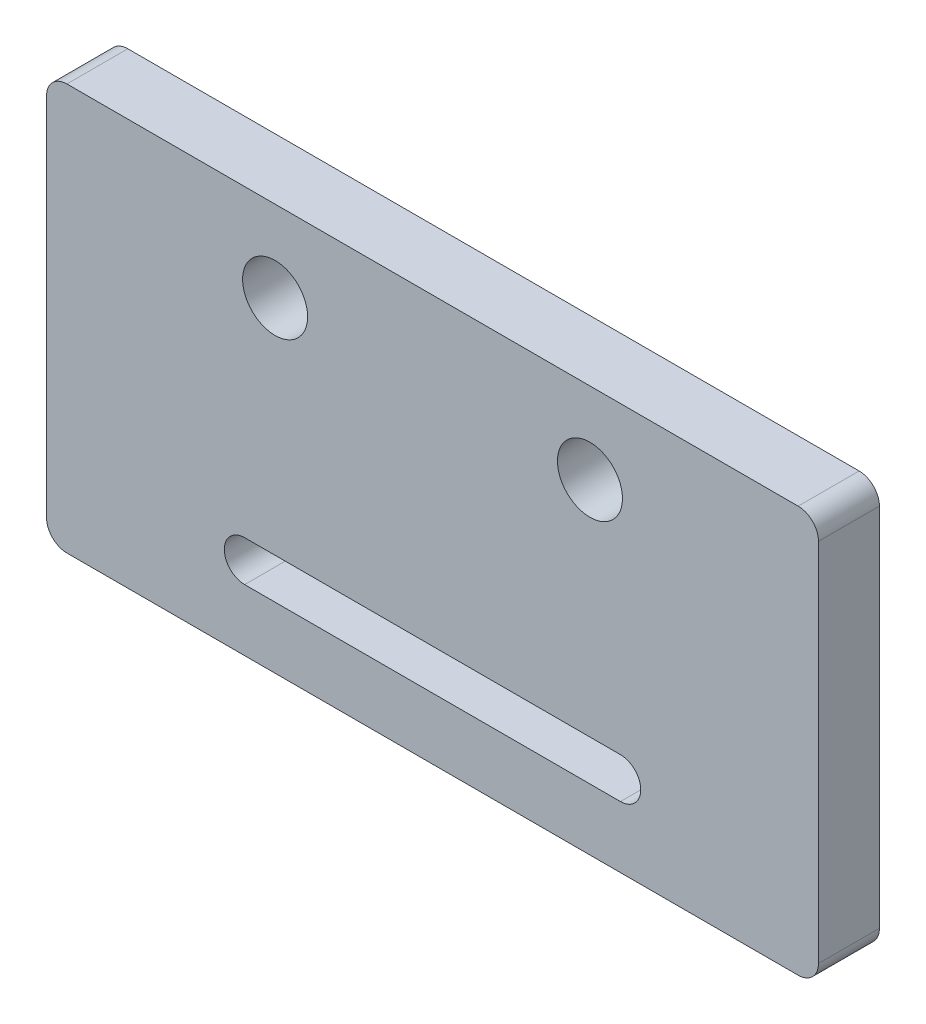
ISO-10303-21;
HEADER;
FILE_DESCRIPTION(('STEP AP214'),'2;1');
FILE_NAME('part.step','',(''),(''),'','','');
FILE_SCHEMA(('AUTOMOTIVE_DESIGN { 1 0 10303 214 1 1 1 1 }'));
ENDSEC;
DATA;
#1=APPLICATION_CONTEXT('core data for automotive mechanical design processes');
#2=APPLICATION_PROTOCOL_DEFINITION('international standard','automotive_design',2000,#1);
#3=PRODUCT_CONTEXT('',#1,'mechanical');
#4=PRODUCT('Part','Part','',(#3));
#5=PRODUCT_RELATED_PRODUCT_CATEGORY('part','',(#4));
#6=PRODUCT_DEFINITION_FORMATION('','',#4);
#7=PRODUCT_DEFINITION_CONTEXT('part definition',#1,'design');
#8=PRODUCT_DEFINITION('design','',#6,#7);
#9=PRODUCT_DEFINITION_SHAPE('','',#8);
#10=(LENGTH_UNIT() NAMED_UNIT(*) SI_UNIT(.MILLI.,.METRE.));
#11=(NAMED_UNIT(*) PLANE_ANGLE_UNIT() SI_UNIT($,.RADIAN.));
#12=(NAMED_UNIT(*) SI_UNIT($,.STERADIAN.) SOLID_ANGLE_UNIT());
#13=UNCERTAINTY_MEASURE_WITH_UNIT(LENGTH_MEASURE(1.E-05),#10,'distance_accuracy_value','');
#14=(GEOMETRIC_REPRESENTATION_CONTEXT(3) GLOBAL_UNCERTAINTY_ASSIGNED_CONTEXT((#13)) GLOBAL_UNIT_ASSIGNED_CONTEXT((#10,
#11,#12)) REPRESENTATION_CONTEXT('',''));
#15=CARTESIAN_POINT('',(0.,0.,0.));
#16=DIRECTION('',(0.,0.,1.));
#17=DIRECTION('',(1.,0.,0.));
#18=AXIS2_PLACEMENT_3D('',#15,#16,#17);
#19=CARTESIAN_POINT('',(0.,0.,3.));
#20=DIRECTION('',(0.,0.,1.));
#21=DIRECTION('',(1.,0.,0.));
#22=AXIS2_PLACEMENT_3D('',#19,#20,#21);
#23=PLANE('',#22);
#24=DIRECTION('',(0.,-1.,0.));
#25=VECTOR('',#24,1.);
#26=CARTESIAN_POINT('',(-38.,0.,3.));
#27=LINE('',#26,#25);
#28=CARTESIAN_POINT('',(-38.,19.,3.));
#29=VERTEX_POINT('',#28);
#30=CARTESIAN_POINT('',(-38.,1.,3.));
#31=VERTEX_POINT('',#30);
#32=EDGE_CURVE('E186',#29,#31,#27,.T.);
#33=ORIENTED_EDGE('',*,*,#32,.T.);
#34=CARTESIAN_POINT('',(-37.,1.,3.));
#35=DIRECTION('',(0.,0.,1.));
#36=DIRECTION('',(1.,0.,0.));
#37=AXIS2_PLACEMENT_3D('',#34,#35,#36);
#38=CIRCLE('',#37,1.);
#39=CARTESIAN_POINT('',(-37.,0.,3.));
#40=VERTEX_POINT('',#39);
#41=EDGE_CURVE('E224',#31,#40,#38,.T.);
#42=ORIENTED_EDGE('',*,*,#41,.T.);
#43=DIRECTION('',(1.,0.,0.));
#44=VECTOR('',#43,1.);
#45=CARTESIAN_POINT('',(0.,0.,3.));
#46=LINE('',#45,#44);
#47=CARTESIAN_POINT('',(-1.,0.,3.));
#48=VERTEX_POINT('',#47);
#49=EDGE_CURVE('E189',#40,#48,#46,.T.);
#50=ORIENTED_EDGE('',*,*,#49,.T.);
#51=CARTESIAN_POINT('',(-1.,1.,3.));
#52=DIRECTION('',(0.,0.,1.));
#53=DIRECTION('',(1.,0.,0.));
#54=AXIS2_PLACEMENT_3D('',#51,#52,#53);
#55=CIRCLE('',#54,1.);
#56=CARTESIAN_POINT('',(0.,1.,3.));
#57=VERTEX_POINT('',#56);
#58=EDGE_CURVE('E222',#48,#57,#55,.T.);
#59=ORIENTED_EDGE('',*,*,#58,.T.);
#60=DIRECTION('',(0.,1.,0.));
#61=VECTOR('',#60,1.);
#62=CARTESIAN_POINT('',(0.,0.,3.));
#63=LINE('',#62,#61);
#64=CARTESIAN_POINT('',(0.,19.,3.));
#65=VERTEX_POINT('',#64);
#66=EDGE_CURVE('E181',#57,#65,#63,.T.);
#67=ORIENTED_EDGE('',*,*,#66,.T.);
#68=CARTESIAN_POINT('',(-1.,19.,3.));
#69=DIRECTION('',(0.,0.,1.));
#70=DIRECTION('',(1.,0.,0.));
#71=AXIS2_PLACEMENT_3D('',#68,#69,#70);
#72=CIRCLE('',#71,1.);
#73=CARTESIAN_POINT('',(-1.,20.,3.));
#74=VERTEX_POINT('',#73);
#75=EDGE_CURVE('E57',#65,#74,#72,.T.);
#76=ORIENTED_EDGE('',*,*,#75,.T.);
#77=DIRECTION('',(-1.,0.,0.));
#78=VECTOR('',#77,1.);
#79=CARTESIAN_POINT('',(0.,20.,3.));
#80=LINE('',#79,#78);
#81=CARTESIAN_POINT('',(-37.,20.,3.));
#82=VERTEX_POINT('',#81);
#83=EDGE_CURVE('E183',#74,#82,#80,.T.);
#84=ORIENTED_EDGE('',*,*,#83,.T.);
#85=CARTESIAN_POINT('',(-37.,19.,3.));
#86=DIRECTION('',(0.,0.,1.));
#87=DIRECTION('',(1.,0.,0.));
#88=AXIS2_PLACEMENT_3D('',#85,#86,#87);
#89=CIRCLE('',#88,1.);
#90=EDGE_CURVE('E219',#82,#29,#89,.T.);
#91=ORIENTED_EDGE('',*,*,#90,.T.);
#92=EDGE_LOOP('',(#33,#42,#50,#59,#67,#76,#84,#91));
#93=FACE_BOUND('',#92,.T.);
#94=CARTESIAN_POINT('',(-26.75,16.,3.));
#95=DIRECTION('',(0.,0.,1.));
#96=DIRECTION('',(1.,0.,0.));
#97=AXIS2_PLACEMENT_3D('',#94,#95,#96);
#98=CIRCLE('',#97,1.6);
#99=CARTESIAN_POINT('',(-25.15,16.,3.));
#100=VERTEX_POINT('',#99);
#101=EDGE_CURVE('E174',#100,#100,#98,.T.);
#102=ORIENTED_EDGE('',*,*,#101,.F.);
#103=EDGE_LOOP('',(#102));
#104=FACE_BOUND('',#103,.T.);
#105=CARTESIAN_POINT('',(-11.25,16.,3.));
#106=DIRECTION('',(0.,0.,1.));
#107=DIRECTION('',(1.,0.,0.));
#108=AXIS2_PLACEMENT_3D('',#105,#106,#107);
#109=CIRCLE('',#108,1.6);
#110=CARTESIAN_POINT('',(-9.65,16.,3.));
#111=VERTEX_POINT('',#110);
#112=EDGE_CURVE('E165',#111,#111,#109,.T.);
#113=ORIENTED_EDGE('',*,*,#112,.F.);
#114=EDGE_LOOP('',(#113));
#115=FACE_BOUND('',#114,.T.);
#116=CARTESIAN_POINT('',(-9.75,4.03,3.));
#117=DIRECTION('',(0.,0.,1.));
#118=DIRECTION('',(1.,0.,0.));
#119=AXIS2_PLACEMENT_3D('',#116,#117,#118);
#120=CIRCLE('',#119,1.);
#121=CARTESIAN_POINT('',(-9.75,3.03,3.));
#122=VERTEX_POINT('',#121);
#123=CARTESIAN_POINT('',(-9.75,5.03,3.));
#124=VERTEX_POINT('',#123);
#125=EDGE_CURVE('E159',#122,#124,#120,.T.);
#126=ORIENTED_EDGE('',*,*,#125,.F.);
#127=DIRECTION('',(-1.,0.,0.));
#128=VECTOR('',#127,1.);
#129=CARTESIAN_POINT('',(0.,3.03000000000001,3.));
#130=LINE('',#129,#128);
#131=CARTESIAN_POINT('',(-28.25,3.03,3.));
#132=VERTEX_POINT('',#131);
#133=EDGE_CURVE('E132',#122,#132,#130,.T.);
#134=ORIENTED_EDGE('',*,*,#133,.T.);
#135=CARTESIAN_POINT('',(-28.25,4.03,3.));
#136=DIRECTION('',(0.,0.,1.));
#137=DIRECTION('',(1.,0.,0.));
#138=AXIS2_PLACEMENT_3D('',#135,#136,#137);
#139=CIRCLE('',#138,1.);
#140=CARTESIAN_POINT('',(-28.25,5.03,3.));
#141=VERTEX_POINT('',#140);
#142=EDGE_CURVE('E150',#141,#132,#139,.T.);
#143=ORIENTED_EDGE('',*,*,#142,.F.);
#144=DIRECTION('',(-1.,0.,0.));
#145=VECTOR('',#144,1.);
#146=CARTESIAN_POINT('',(0.,5.03000000000001,3.));
#147=LINE('',#146,#145);
#148=EDGE_CURVE('E153',#124,#141,#147,.T.);
#149=ORIENTED_EDGE('',*,*,#148,.F.);
#150=EDGE_LOOP('',(#126,#134,#143,#149));
#151=FACE_BOUND('',#150,.T.);
#152=ADVANCED_FACE('F36',(#93,#104,#115,#151),#23,.T.);
#153=CARTESIAN_POINT('',(0.,0.,0.));
#154=DIRECTION('',(0.,0.,1.));
#155=DIRECTION('',(1.,0.,0.));
#156=AXIS2_PLACEMENT_3D('',#153,#154,#155);
#157=PLANE('',#156);
#158=DIRECTION('',(1.,0.,0.));
#159=VECTOR('',#158,1.);
#160=CARTESIAN_POINT('',(0.,0.,0.));
#161=LINE('',#160,#159);
#162=CARTESIAN_POINT('',(-37.,0.,0.));
#163=VERTEX_POINT('',#162);
#164=CARTESIAN_POINT('',(-1.,0.,0.));
#165=VERTEX_POINT('',#164);
#166=EDGE_CURVE('E184',#163,#165,#161,.T.);
#167=ORIENTED_EDGE('',*,*,#166,.F.);
#168=CARTESIAN_POINT('',(-37.,1.,0.));
#169=DIRECTION('',(0.,0.,1.));
#170=DIRECTION('',(1.,0.,0.));
#171=AXIS2_PLACEMENT_3D('',#168,#169,#170);
#172=CIRCLE('',#171,1.);
#173=CARTESIAN_POINT('',(-38.,1.,0.));
#174=VERTEX_POINT('',#173);
#175=EDGE_CURVE('E212',#163,#174,#172,.F.);
#176=ORIENTED_EDGE('',*,*,#175,.T.);
#177=DIRECTION('',(0.,-1.,0.));
#178=VECTOR('',#177,1.);
#179=CARTESIAN_POINT('',(-38.,0.,0.));
#180=LINE('',#179,#178);
#181=CARTESIAN_POINT('',(-38.,19.,0.));
#182=VERTEX_POINT('',#181);
#183=EDGE_CURVE('E197',#182,#174,#180,.T.);
#184=ORIENTED_EDGE('',*,*,#183,.F.);
#185=CARTESIAN_POINT('',(-37.,19.,0.));
#186=DIRECTION('',(0.,0.,1.));
#187=DIRECTION('',(1.,0.,0.));
#188=AXIS2_PLACEMENT_3D('',#185,#186,#187);
#189=CIRCLE('',#188,1.);
#190=CARTESIAN_POINT('',(-37.,20.,0.));
#191=VERTEX_POINT('',#190);
#192=EDGE_CURVE('E206',#182,#191,#189,.F.);
#193=ORIENTED_EDGE('',*,*,#192,.T.);
#194=DIRECTION('',(-1.,0.,0.));
#195=VECTOR('',#194,1.);
#196=CARTESIAN_POINT('',(0.,20.,0.));
#197=LINE('',#196,#195);
#198=CARTESIAN_POINT('',(-1.,20.,0.));
#199=VERTEX_POINT('',#198);
#200=EDGE_CURVE('E195',#199,#191,#197,.T.);
#201=ORIENTED_EDGE('',*,*,#200,.F.);
#202=CARTESIAN_POINT('',(-1.,19.,0.));
#203=DIRECTION('',(0.,0.,1.));
#204=DIRECTION('',(1.,0.,0.));
#205=AXIS2_PLACEMENT_3D('',#202,#203,#204);
#206=CIRCLE('',#205,1.);
#207=CARTESIAN_POINT('',(0.,19.,0.));
#208=VERTEX_POINT('',#207);
#209=EDGE_CURVE('E208',#199,#208,#206,.F.);
#210=ORIENTED_EDGE('',*,*,#209,.T.);
#211=DIRECTION('',(0.,1.,0.));
#212=VECTOR('',#211,1.);
#213=CARTESIAN_POINT('',(0.,0.,0.));
#214=LINE('',#213,#212);
#215=CARTESIAN_POINT('',(0.,1.,0.));
#216=VERTEX_POINT('',#215);
#217=EDGE_CURVE('E180',#216,#208,#214,.T.);
#218=ORIENTED_EDGE('',*,*,#217,.F.);
#219=CARTESIAN_POINT('',(-1.,1.,0.));
#220=DIRECTION('',(0.,0.,1.));
#221=DIRECTION('',(1.,0.,0.));
#222=AXIS2_PLACEMENT_3D('',#219,#220,#221);
#223=CIRCLE('',#222,1.);
#224=EDGE_CURVE('E210',#216,#165,#223,.F.);
#225=ORIENTED_EDGE('',*,*,#224,.T.);
#226=EDGE_LOOP('',(#167,#176,#184,#193,#201,#210,#218,#225));
#227=FACE_BOUND('',#226,.T.);
#228=CARTESIAN_POINT('',(-26.75,16.,0.));
#229=DIRECTION('',(0.,0.,1.));
#230=DIRECTION('',(1.,0.,0.));
#231=AXIS2_PLACEMENT_3D('',#228,#229,#230);
#232=CIRCLE('',#231,1.6);
#233=CARTESIAN_POINT('',(-25.15,16.,0.));
#234=VERTEX_POINT('',#233);
#235=EDGE_CURVE('E177',#234,#234,#232,.T.);
#236=ORIENTED_EDGE('',*,*,#235,.T.);
#237=EDGE_LOOP('',(#236));
#238=FACE_BOUND('',#237,.T.);
#239=CARTESIAN_POINT('',(-11.25,16.,0.));
#240=DIRECTION('',(0.,0.,1.));
#241=DIRECTION('',(1.,0.,0.));
#242=AXIS2_PLACEMENT_3D('',#239,#240,#241);
#243=CIRCLE('',#242,1.6);
#244=CARTESIAN_POINT('',(-9.65,16.,0.));
#245=VERTEX_POINT('',#244);
#246=EDGE_CURVE('E171',#245,#245,#243,.T.);
#247=ORIENTED_EDGE('',*,*,#246,.T.);
#248=EDGE_LOOP('',(#247));
#249=FACE_BOUND('',#248,.T.);
#250=DIRECTION('',(-1.,0.,0.));
#251=VECTOR('',#250,1.);
#252=CARTESIAN_POINT('',(0.,3.03000000000001,0.));
#253=LINE('',#252,#251);
#254=CARTESIAN_POINT('',(-9.75,3.03,0.));
#255=VERTEX_POINT('',#254);
#256=CARTESIAN_POINT('',(-28.25,3.03,0.));
#257=VERTEX_POINT('',#256);
#258=EDGE_CURVE('E129',#255,#257,#253,.T.);
#259=ORIENTED_EDGE('',*,*,#258,.F.);
#260=CARTESIAN_POINT('',(-9.75,4.03,0.));
#261=DIRECTION('',(0.,0.,1.));
#262=DIRECTION('',(1.,0.,0.));
#263=AXIS2_PLACEMENT_3D('',#260,#261,#262);
#264=CIRCLE('',#263,1.);
#265=CARTESIAN_POINT('',(-9.75,5.03,0.));
#266=VERTEX_POINT('',#265);
#267=EDGE_CURVE('E141',#255,#266,#264,.T.);
#268=ORIENTED_EDGE('',*,*,#267,.T.);
#269=DIRECTION('',(-1.,0.,0.));
#270=VECTOR('',#269,1.);
#271=CARTESIAN_POINT('',(0.,5.03000000000001,0.));
#272=LINE('',#271,#270);
#273=CARTESIAN_POINT('',(-28.25,5.03,0.));
#274=VERTEX_POINT('',#273);
#275=EDGE_CURVE('E145',#266,#274,#272,.T.);
#276=ORIENTED_EDGE('',*,*,#275,.T.);
#277=CARTESIAN_POINT('',(-28.25,4.03,0.));
#278=DIRECTION('',(0.,0.,1.));
#279=DIRECTION('',(1.,0.,0.));
#280=AXIS2_PLACEMENT_3D('',#277,#278,#279);
#281=CIRCLE('',#280,1.);
#282=EDGE_CURVE('E137',#274,#257,#281,.T.);
#283=ORIENTED_EDGE('',*,*,#282,.T.);
#284=EDGE_LOOP('',(#259,#268,#276,#283));
#285=FACE_BOUND('',#284,.T.);
#286=ADVANCED_FACE('F148',(#227,#238,#249,#285),#157,.F.);
#287=CARTESIAN_POINT('',(0.,0.,3.));
#288=DIRECTION('',(-1.,0.,0.));
#289=DIRECTION('',(0.,0.,1.));
#290=AXIS2_PLACEMENT_3D('',#287,#288,#289);
#291=PLANE('',#290);
#292=ORIENTED_EDGE('',*,*,#66,.F.);
#293=DIRECTION('',(0.,0.,-1.));
#294=VECTOR('',#293,1.);
#295=CARTESIAN_POINT('',(0.,1.,3.));
#296=LINE('',#295,#294);
#297=EDGE_CURVE('E228',#57,#216,#296,.T.);
#298=ORIENTED_EDGE('',*,*,#297,.T.);
#299=ORIENTED_EDGE('',*,*,#217,.T.);
#300=DIRECTION('',(0.,0.,-1.));
#301=VECTOR('',#300,1.);
#302=CARTESIAN_POINT('',(0.,19.,3.));
#303=LINE('',#302,#301);
#304=EDGE_CURVE('E226',#208,#65,#303,.F.);
#305=ORIENTED_EDGE('',*,*,#304,.T.);
#306=EDGE_LOOP('',(#292,#298,#299,#305));
#307=FACE_BOUND('',#306,.T.);
#308=ADVANCED_FACE('F234',(#307),#291,.F.);
#309=CARTESIAN_POINT('',(0.,20.,3.));
#310=DIRECTION('',(0.,-1.,0.));
#311=DIRECTION('',(1.,0.,0.));
#312=AXIS2_PLACEMENT_3D('',#309,#310,#311);
#313=PLANE('',#312);
#314=ORIENTED_EDGE('',*,*,#83,.F.);
#315=DIRECTION('',(0.,0.,-1.));
#316=VECTOR('',#315,1.);
#317=CARTESIAN_POINT('',(-1.,20.,3.));
#318=LINE('',#317,#316);
#319=EDGE_CURVE('E11',#74,#199,#318,.T.);
#320=ORIENTED_EDGE('',*,*,#319,.T.);
#321=ORIENTED_EDGE('',*,*,#200,.T.);
#322=DIRECTION('',(0.,0.,-1.));
#323=VECTOR('',#322,1.);
#324=CARTESIAN_POINT('',(-37.,20.,3.));
#325=LINE('',#324,#323);
#326=EDGE_CURVE('E44',#191,#82,#325,.F.);
#327=ORIENTED_EDGE('',*,*,#326,.T.);
#328=EDGE_LOOP('',(#314,#320,#321,#327));
#329=FACE_BOUND('',#328,.T.);
#330=ADVANCED_FACE('F245',(#329),#313,.F.);
#331=CARTESIAN_POINT('',(-38.,0.,3.));
#332=DIRECTION('',(1.,0.,0.));
#333=DIRECTION('',(0.,0.,-1.));
#334=AXIS2_PLACEMENT_3D('',#331,#332,#333);
#335=PLANE('',#334);
#336=ORIENTED_EDGE('',*,*,#183,.T.);
#337=DIRECTION('',(0.,0.,-1.));
#338=VECTOR('',#337,1.);
#339=CARTESIAN_POINT('',(-38.,1.,3.));
#340=LINE('',#339,#338);
#341=EDGE_CURVE('E217',#174,#31,#340,.F.);
#342=ORIENTED_EDGE('',*,*,#341,.T.);
#343=ORIENTED_EDGE('',*,*,#32,.F.);
#344=DIRECTION('',(0.,0.,-1.));
#345=VECTOR('',#344,1.);
#346=CARTESIAN_POINT('',(-38.,19.,3.));
#347=LINE('',#346,#345);
#348=EDGE_CURVE('E214',#29,#182,#347,.T.);
#349=ORIENTED_EDGE('',*,*,#348,.T.);
#350=EDGE_LOOP('',(#336,#342,#343,#349));
#351=FACE_BOUND('',#350,.T.);
#352=ADVANCED_FACE('F253',(#351),#335,.F.);
#353=CARTESIAN_POINT('',(0.,0.,3.));
#354=DIRECTION('',(0.,1.,0.));
#355=DIRECTION('',(0.,0.,1.));
#356=AXIS2_PLACEMENT_3D('',#353,#354,#355);
#357=PLANE('',#356);
#358=ORIENTED_EDGE('',*,*,#49,.F.);
#359=DIRECTION('',(0.,0.,-1.));
#360=VECTOR('',#359,1.);
#361=CARTESIAN_POINT('',(-37.,0.,3.));
#362=LINE('',#361,#360);
#363=EDGE_CURVE('E203',#40,#163,#362,.T.);
#364=ORIENTED_EDGE('',*,*,#363,.T.);
#365=ORIENTED_EDGE('',*,*,#166,.T.);
#366=DIRECTION('',(0.,0.,-1.));
#367=VECTOR('',#366,1.);
#368=CARTESIAN_POINT('',(-1.,0.,3.));
#369=LINE('',#368,#367);
#370=EDGE_CURVE('E192',#165,#48,#369,.F.);
#371=ORIENTED_EDGE('',*,*,#370,.T.);
#372=EDGE_LOOP('',(#358,#364,#365,#371));
#373=FACE_BOUND('',#372,.T.);
#374=ADVANCED_FACE('F261',(#373),#357,.F.);
#375=CARTESIAN_POINT('',(-26.75,16.,3.));
#376=DIRECTION('',(0.,0.,1.));
#377=DIRECTION('',(1.,0.,0.));
#378=AXIS2_PLACEMENT_3D('',#375,#376,#377);
#379=CYLINDRICAL_SURFACE('',#378,1.6);
#380=ORIENTED_EDGE('',*,*,#101,.T.);
#381=EDGE_LOOP('',(#380));
#382=FACE_BOUND('',#381,.T.);
#383=ORIENTED_EDGE('',*,*,#235,.F.);
#384=EDGE_LOOP('',(#383));
#385=FACE_BOUND('',#384,.T.);
#386=ADVANCED_FACE('F278',(#382,#385),#379,.F.);
#387=CARTESIAN_POINT('',(-11.25,16.,3.));
#388=DIRECTION('',(0.,0.,1.));
#389=DIRECTION('',(1.,0.,0.));
#390=AXIS2_PLACEMENT_3D('',#387,#388,#389);
#391=CYLINDRICAL_SURFACE('',#390,1.6);
#392=ORIENTED_EDGE('',*,*,#112,.T.);
#393=EDGE_LOOP('',(#392));
#394=FACE_BOUND('',#393,.T.);
#395=ORIENTED_EDGE('',*,*,#246,.F.);
#396=EDGE_LOOP('',(#395));
#397=FACE_BOUND('',#396,.T.);
#398=ADVANCED_FACE('F311',(#394,#397),#391,.F.);
#399=CARTESIAN_POINT('',(0.,3.03000000000001,0.));
#400=DIRECTION('',(0.,1.,0.));
#401=DIRECTION('',(-1.,0.,0.));
#402=AXIS2_PLACEMENT_3D('',#399,#400,#401);
#403=PLANE('',#402);
#404=ORIENTED_EDGE('',*,*,#133,.F.);
#405=DIRECTION('',(0.,0.,1.));
#406=VECTOR('',#405,1.);
#407=CARTESIAN_POINT('',(-9.75,3.03,0.));
#408=LINE('',#407,#406);
#409=EDGE_CURVE('E125',#255,#122,#408,.T.);
#410=ORIENTED_EDGE('',*,*,#409,.F.);
#411=ORIENTED_EDGE('',*,*,#258,.T.);
#412=DIRECTION('',(0.,0.,1.));
#413=VECTOR('',#412,1.);
#414=CARTESIAN_POINT('',(-28.25,3.03,0.));
#415=LINE('',#414,#413);
#416=EDGE_CURVE('E163',#257,#132,#415,.T.);
#417=ORIENTED_EDGE('',*,*,#416,.T.);
#418=EDGE_LOOP('',(#404,#410,#411,#417));
#419=FACE_BOUND('',#418,.T.);
#420=ADVANCED_FACE('F127',(#419),#403,.T.);
#421=CARTESIAN_POINT('',(-28.25,4.03,0.));
#422=DIRECTION('',(0.,0.,1.));
#423=DIRECTION('',(1.,0.,0.));
#424=AXIS2_PLACEMENT_3D('',#421,#422,#423);
#425=CYLINDRICAL_SURFACE('',#424,1.);
#426=ORIENTED_EDGE('',*,*,#142,.T.);
#427=ORIENTED_EDGE('',*,*,#416,.F.);
#428=ORIENTED_EDGE('',*,*,#282,.F.);
#429=DIRECTION('',(0.,0.,1.));
#430=VECTOR('',#429,1.);
#431=CARTESIAN_POINT('',(-28.25,5.03,0.));
#432=LINE('',#431,#430);
#433=EDGE_CURVE('E166',#274,#141,#432,.T.);
#434=ORIENTED_EDGE('',*,*,#433,.T.);
#435=EDGE_LOOP('',(#426,#427,#428,#434));
#436=FACE_BOUND('',#435,.T.);
#437=ADVANCED_FACE('F324',(#436),#425,.F.);
#438=CARTESIAN_POINT('',(0.,5.03000000000001,0.));
#439=DIRECTION('',(0.,1.,0.));
#440=DIRECTION('',(-1.,0.,0.));
#441=AXIS2_PLACEMENT_3D('',#438,#439,#440);
#442=PLANE('',#441);
#443=ORIENTED_EDGE('',*,*,#148,.T.);
#444=ORIENTED_EDGE('',*,*,#433,.F.);
#445=ORIENTED_EDGE('',*,*,#275,.F.);
#446=DIRECTION('',(0.,0.,1.));
#447=VECTOR('',#446,1.);
#448=CARTESIAN_POINT('',(-9.75,5.03,0.));
#449=LINE('',#448,#447);
#450=EDGE_CURVE('E136',#266,#124,#449,.T.);
#451=ORIENTED_EDGE('',*,*,#450,.T.);
#452=EDGE_LOOP('',(#443,#444,#445,#451));
#453=FACE_BOUND('',#452,.T.);
#454=ADVANCED_FACE('F331',(#453),#442,.F.);
#455=CARTESIAN_POINT('',(-9.75,4.03,0.));
#456=DIRECTION('',(0.,0.,1.));
#457=DIRECTION('',(1.,0.,0.));
#458=AXIS2_PLACEMENT_3D('',#455,#456,#457);
#459=CYLINDRICAL_SURFACE('',#458,1.);
#460=ORIENTED_EDGE('',*,*,#125,.T.);
#461=ORIENTED_EDGE('',*,*,#450,.F.);
#462=ORIENTED_EDGE('',*,*,#267,.F.);
#463=ORIENTED_EDGE('',*,*,#409,.T.);
#464=EDGE_LOOP('',(#460,#461,#462,#463));
#465=FACE_BOUND('',#464,.T.);
#466=ADVANCED_FACE('F142',(#465),#459,.F.);
#467=CARTESIAN_POINT('',(-37.,1.,3.));
#468=DIRECTION('',(0.,0.,-1.));
#469=DIRECTION('',(-1.,0.,0.));
#470=AXIS2_PLACEMENT_3D('',#467,#468,#469);
#471=CYLINDRICAL_SURFACE('',#470,1.);
#472=ORIENTED_EDGE('',*,*,#41,.F.);
#473=ORIENTED_EDGE('',*,*,#341,.F.);
#474=ORIENTED_EDGE('',*,*,#175,.F.);
#475=ORIENTED_EDGE('',*,*,#363,.F.);
#476=EDGE_LOOP('',(#472,#473,#474,#475));
#477=FACE_BOUND('',#476,.T.);
#478=ADVANCED_FACE('F258',(#477),#471,.T.);
#479=CARTESIAN_POINT('',(-1.,1.,3.));
#480=DIRECTION('',(0.,0.,-1.));
#481=DIRECTION('',(-1.,0.,0.));
#482=AXIS2_PLACEMENT_3D('',#479,#480,#481);
#483=CYLINDRICAL_SURFACE('',#482,1.);
#484=ORIENTED_EDGE('',*,*,#58,.F.);
#485=ORIENTED_EDGE('',*,*,#370,.F.);
#486=ORIENTED_EDGE('',*,*,#224,.F.);
#487=ORIENTED_EDGE('',*,*,#297,.F.);
#488=EDGE_LOOP('',(#484,#485,#486,#487));
#489=FACE_BOUND('',#488,.T.);
#490=ADVANCED_FACE('F263',(#489),#483,.T.);
#491=CARTESIAN_POINT('',(-1.,19.,3.));
#492=DIRECTION('',(0.,0.,-1.));
#493=DIRECTION('',(-1.,0.,0.));
#494=AXIS2_PLACEMENT_3D('',#491,#492,#493);
#495=CYLINDRICAL_SURFACE('',#494,1.);
#496=ORIENTED_EDGE('',*,*,#75,.F.);
#497=ORIENTED_EDGE('',*,*,#304,.F.);
#498=ORIENTED_EDGE('',*,*,#209,.F.);
#499=ORIENTED_EDGE('',*,*,#319,.F.);
#500=EDGE_LOOP('',(#496,#497,#498,#499));
#501=FACE_BOUND('',#500,.T.);
#502=ADVANCED_FACE('F244',(#501),#495,.T.);
#503=CARTESIAN_POINT('',(-37.,19.,3.));
#504=DIRECTION('',(0.,0.,-1.));
#505=DIRECTION('',(-1.,0.,0.));
#506=AXIS2_PLACEMENT_3D('',#503,#504,#505);
#507=CYLINDRICAL_SURFACE('',#506,1.);
#508=ORIENTED_EDGE('',*,*,#90,.F.);
#509=ORIENTED_EDGE('',*,*,#326,.F.);
#510=ORIENTED_EDGE('',*,*,#192,.F.);
#511=ORIENTED_EDGE('',*,*,#348,.F.);
#512=EDGE_LOOP('',(#508,#509,#510,#511));
#513=FACE_BOUND('',#512,.T.);
#514=ADVANCED_FACE('F38',(#513),#507,.T.);
#515=CLOSED_SHELL('',(#152,#286,#308,#330,#352,#374,#386,#398,#420,#437,#454,#466,#478,#490,
#502,#514));
#516=MANIFOLD_SOLID_BREP('B2',#515);
#517=ADVANCED_BREP_SHAPE_REPRESENTATION('',(#18,#516),#14);
#518=SHAPE_DEFINITION_REPRESENTATION(#9,#517);
ENDSEC;
END-ISO-10303-21;
